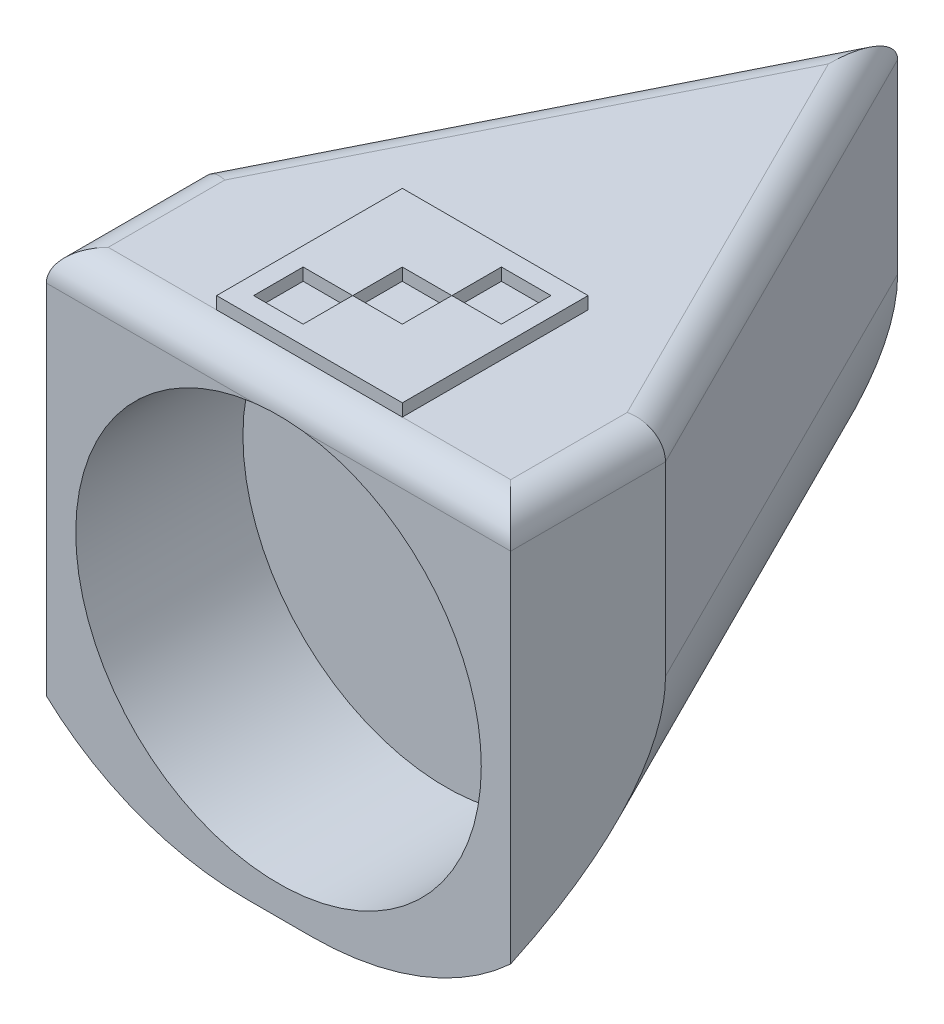
ISO-10303-21;
HEADER;
FILE_DESCRIPTION(('STEP AP214'),'2;1');
FILE_NAME('part.step','',(''),(''),'','','');
FILE_SCHEMA(('AUTOMOTIVE_DESIGN { 1 0 10303 214 1 1 1 1 }'));
ENDSEC;
DATA;
#1=APPLICATION_CONTEXT('core data for automotive mechanical design processes');
#2=APPLICATION_PROTOCOL_DEFINITION('international standard','automotive_design',2000,#1);
#3=PRODUCT_CONTEXT('',#1,'mechanical');
#4=PRODUCT('Part','Part','',(#3));
#5=PRODUCT_RELATED_PRODUCT_CATEGORY('part','',(#4));
#6=PRODUCT_DEFINITION_FORMATION('','',#4);
#7=PRODUCT_DEFINITION_CONTEXT('part definition',#1,'design');
#8=PRODUCT_DEFINITION('design','',#6,#7);
#9=PRODUCT_DEFINITION_SHAPE('','',#8);
#10=(LENGTH_UNIT() NAMED_UNIT(*) SI_UNIT(.MILLI.,.METRE.));
#11=(NAMED_UNIT(*) PLANE_ANGLE_UNIT() SI_UNIT($,.RADIAN.));
#12=(NAMED_UNIT(*) SI_UNIT($,.STERADIAN.) SOLID_ANGLE_UNIT());
#13=UNCERTAINTY_MEASURE_WITH_UNIT(LENGTH_MEASURE(1.E-05),#10,'distance_accuracy_value','');
#14=(GEOMETRIC_REPRESENTATION_CONTEXT(3) GLOBAL_UNCERTAINTY_ASSIGNED_CONTEXT((#13)) GLOBAL_UNIT_ASSIGNED_CONTEXT((#10,
#11,#12)) REPRESENTATION_CONTEXT('',''));
#15=CARTESIAN_POINT('',(0.,0.,0.));
#16=DIRECTION('',(0.,0.,1.));
#17=DIRECTION('',(1.,0.,0.));
#18=AXIS2_PLACEMENT_3D('',#15,#16,#17);
#19=CARTESIAN_POINT('',(0.,77.,0.));
#20=DIRECTION('',(0.,-1.,0.));
#21=DIRECTION('',(0.,0.,-1.));
#22=AXIS2_PLACEMENT_3D('',#19,#20,#21);
#23=PLANE('',#22);
#24=DIRECTION('',(1.,0.,0.));
#25=VECTOR('',#24,1.);
#26=CARTESIAN_POINT('',(-4.00520382004282,77.,76.0052038200428));
#27=LINE('',#26,#25);
#28=CARTESIAN_POINT('',(-4.00520382004282,77.,76.0052038200428));
#29=VERTEX_POINT('',#28);
#30=CARTESIAN_POINT('',(3.99479617995719,77.,76.0052038200428));
#31=VERTEX_POINT('',#30);
#32=EDGE_CURVE('E65',#29,#31,#27,.T.);
#33=ORIENTED_EDGE('',*,*,#32,.T.);
#34=DIRECTION('',(0.,0.,-1.));
#35=VECTOR('',#34,1.);
#36=CARTESIAN_POINT('',(3.99479617995719,77.,84.0052038200428));
#37=LINE('',#36,#35);
#38=CARTESIAN_POINT('',(3.99479617995719,77.,84.0052038200428));
#39=VERTEX_POINT('',#38);
#40=EDGE_CURVE('E289',#39,#31,#37,.T.);
#41=ORIENTED_EDGE('',*,*,#40,.F.);
#42=DIRECTION('',(1.,0.,0.));
#43=VECTOR('',#42,1.);
#44=CARTESIAN_POINT('',(-4.00520382004282,77.,84.0052038200428));
#45=LINE('',#44,#43);
#46=CARTESIAN_POINT('',(-4.00520382004282,77.,84.0052038200428));
#47=VERTEX_POINT('',#46);
#48=EDGE_CURVE('E284',#47,#39,#45,.T.);
#49=ORIENTED_EDGE('',*,*,#48,.F.);
#50=DIRECTION('',(0.,0.,-1.));
#51=VECTOR('',#50,1.);
#52=CARTESIAN_POINT('',(-4.00520382004282,77.,84.0052038200428));
#53=LINE('',#52,#51);
#54=EDGE_CURVE('E280',#47,#29,#53,.T.);
#55=ORIENTED_EDGE('',*,*,#54,.T.);
#56=EDGE_LOOP('',(#33,#41,#49,#55));
#57=FACE_BOUND('',#56,.T.);
#58=DIRECTION('',(-1.,0.,0.));
#59=VECTOR('',#58,1.);
#60=CARTESIAN_POINT('',(15.,77.,65.));
#61=LINE('',#60,#59);
#62=CARTESIAN_POINT('',(15.,77.,65.));
#63=VERTEX_POINT('',#62);
#64=CARTESIAN_POINT('',(-15.,77.,65.));
#65=VERTEX_POINT('',#64);
#66=EDGE_CURVE('E349',#63,#65,#61,.T.);
#67=ORIENTED_EDGE('',*,*,#66,.T.);
#68=DIRECTION('',(0.,0.,-1.));
#69=VECTOR('',#68,1.);
#70=CARTESIAN_POINT('',(-15.,77.,95.));
#71=LINE('',#70,#69);
#72=CARTESIAN_POINT('',(-15.,77.,95.));
#73=VERTEX_POINT('',#72);
#74=EDGE_CURVE('E352',#73,#65,#71,.T.);
#75=ORIENTED_EDGE('',*,*,#74,.F.);
#76=DIRECTION('',(-1.,0.,0.));
#77=VECTOR('',#76,1.);
#78=CARTESIAN_POINT('',(15.,77.,95.));
#79=LINE('',#78,#77);
#80=CARTESIAN_POINT('',(15.,77.,95.));
#81=VERTEX_POINT('',#80);
#82=EDGE_CURVE('E357',#81,#73,#79,.T.);
#83=ORIENTED_EDGE('',*,*,#82,.F.);
#84=DIRECTION('',(0.,0.,-1.));
#85=VECTOR('',#84,1.);
#86=CARTESIAN_POINT('',(15.,77.,95.));
#87=LINE('',#86,#85);
#88=EDGE_CURVE('E361',#81,#63,#87,.T.);
#89=ORIENTED_EDGE('',*,*,#88,.T.);
#90=EDGE_LOOP('',(#67,#75,#83,#89));
#91=FACE_BOUND('',#90,.T.);
#92=DIRECTION('',(1.,0.,0.));
#93=VECTOR('',#92,1.);
#94=CARTESIAN_POINT('',(4.00186724776906,77.,67.998132752231));
#95=LINE('',#94,#93);
#96=CARTESIAN_POINT('',(4.00186724776906,77.,67.998132752231));
#97=VERTEX_POINT('',#96);
#98=CARTESIAN_POINT('',(12.0018672477691,77.,67.998132752231));
#99=VERTEX_POINT('',#98);
#100=EDGE_CURVE('E270',#97,#99,#95,.T.);
#101=ORIENTED_EDGE('',*,*,#100,.T.);
#102=DIRECTION('',(0.,0.,-1.));
#103=VECTOR('',#102,1.);
#104=CARTESIAN_POINT('',(12.0018672477691,77.,75.998132752231));
#105=LINE('',#104,#103);
#106=CARTESIAN_POINT('',(12.0018672477691,77.,75.998132752231));
#107=VERTEX_POINT('',#106);
#108=EDGE_CURVE('E330',#107,#99,#105,.T.);
#109=ORIENTED_EDGE('',*,*,#108,.F.);
#110=DIRECTION('',(1.,0.,0.));
#111=VECTOR('',#110,1.);
#112=CARTESIAN_POINT('',(4.00186724776906,77.,75.998132752231));
#113=LINE('',#112,#111);
#114=CARTESIAN_POINT('',(4.00186724776906,77.,75.998132752231));
#115=VERTEX_POINT('',#114);
#116=EDGE_CURVE('E325',#115,#107,#113,.T.);
#117=ORIENTED_EDGE('',*,*,#116,.F.);
#118=DIRECTION('',(0.,0.,-1.));
#119=VECTOR('',#118,1.);
#120=CARTESIAN_POINT('',(4.00186724776906,77.,75.998132752231));
#121=LINE('',#120,#119);
#122=EDGE_CURVE('E321',#115,#97,#121,.T.);
#123=ORIENTED_EDGE('',*,*,#122,.T.);
#124=EDGE_LOOP('',(#101,#109,#117,#123));
#125=FACE_BOUND('',#124,.T.);
#126=DIRECTION('',(1.,0.,0.));
#127=VECTOR('',#126,1.);
#128=CARTESIAN_POINT('',(-12.0122748878547,77.,84.0122748878547));
#129=LINE('',#128,#127);
#130=CARTESIAN_POINT('',(-12.0122748878547,77.,84.0122748878547));
#131=VERTEX_POINT('',#130);
#132=CARTESIAN_POINT('',(-4.01227488785468,77.,84.0122748878547));
#133=VERTEX_POINT('',#132);
#134=EDGE_CURVE('E57',#131,#133,#129,.T.);
#135=ORIENTED_EDGE('',*,*,#134,.T.);
#136=DIRECTION('',(0.,0.,-1.));
#137=VECTOR('',#136,1.);
#138=CARTESIAN_POINT('',(-4.01227488785467,77.,92.0122748878547));
#139=LINE('',#138,#137);
#140=CARTESIAN_POINT('',(-4.01227488785467,77.,92.0122748878547));
#141=VERTEX_POINT('',#140);
#142=EDGE_CURVE('E232',#141,#133,#139,.T.);
#143=ORIENTED_EDGE('',*,*,#142,.F.);
#144=DIRECTION('',(1.,0.,0.));
#145=VECTOR('',#144,1.);
#146=CARTESIAN_POINT('',(-12.0122748878547,77.,92.0122748878547));
#147=LINE('',#146,#145);
#148=CARTESIAN_POINT('',(-12.0122748878547,77.,92.0122748878547));
#149=VERTEX_POINT('',#148);
#150=EDGE_CURVE('E252',#149,#141,#147,.T.);
#151=ORIENTED_EDGE('',*,*,#150,.F.);
#152=DIRECTION('',(0.,0.,-1.));
#153=VECTOR('',#152,1.);
#154=CARTESIAN_POINT('',(-12.0122748878547,77.,92.0122748878547));
#155=LINE('',#154,#153);
#156=EDGE_CURVE('E225',#149,#131,#155,.T.);
#157=ORIENTED_EDGE('',*,*,#156,.T.);
#158=EDGE_LOOP('',(#135,#143,#151,#157));
#159=FACE_BOUND('',#158,.T.);
#160=ADVANCED_FACE('F39',(#57,#91,#125,#159),#23,.F.);
#161=CARTESIAN_POINT('',(0.,75.,100.));
#162=DIRECTION('',(0.,0.,-1.));
#163=DIRECTION('',(-1.,0.,0.));
#164=AXIS2_PLACEMENT_3D('',#161,#162,#163);
#165=PLANE('',#164);
#166=DIRECTION('',(0.,-1.,0.));
#167=VECTOR('',#166,1.);
#168=CARTESIAN_POINT('',(37.5,75.,100.));
#169=LINE('',#168,#167);
#170=CARTESIAN_POINT('',(37.5,70.,100.));
#171=VERTEX_POINT('',#170);
#172=CARTESIAN_POINT('',(37.5,12.2614493709582,100.));
#173=VERTEX_POINT('',#172);
#174=EDGE_CURVE('E418',#171,#173,#169,.T.);
#175=ORIENTED_EDGE('',*,*,#174,.F.);
#176=DIRECTION('',(1.,0.,0.));
#177=VECTOR('',#176,1.);
#178=CARTESIAN_POINT('',(-37.5,70.,100.));
#179=LINE('',#178,#177);
#180=CARTESIAN_POINT('',(4.03887360535096,70.,100.));
#181=VERTEX_POINT('',#180);
#182=EDGE_CURVE('E49',#171,#181,#179,.F.);
#183=ORIENTED_EDGE('',*,*,#182,.T.);
#184=CARTESIAN_POINT('',(0.,37.5,100.));
#185=DIRECTION('',(0.,0.,1.));
#186=DIRECTION('',(1.,0.,0.));
#187=AXIS2_PLACEMENT_3D('',#184,#185,#186);
#188=CIRCLE('',#187,32.75);
#189=CARTESIAN_POINT('',(-4.03887360535092,70.,100.));
#190=VERTEX_POINT('',#189);
#191=EDGE_CURVE('E398',#190,#181,#188,.T.);
#192=ORIENTED_EDGE('',*,*,#191,.F.);
#193=DIRECTION('',(1.,0.,0.));
#194=VECTOR('',#193,1.);
#195=CARTESIAN_POINT('',(-37.5,70.,100.));
#196=LINE('',#195,#194);
#197=CARTESIAN_POINT('',(-37.5,70.,100.));
#198=VERTEX_POINT('',#197);
#199=EDGE_CURVE('E484',#190,#198,#196,.F.);
#200=ORIENTED_EDGE('',*,*,#199,.T.);
#201=DIRECTION('',(0.,-1.,0.));
#202=VECTOR('',#201,1.);
#203=CARTESIAN_POINT('',(-37.5,75.,100.));
#204=LINE('',#203,#202);
#205=CARTESIAN_POINT('',(-37.5,12.2614493709582,100.));
#206=VERTEX_POINT('',#205);
#207=EDGE_CURVE('E406',#198,#206,#204,.T.);
#208=ORIENTED_EDGE('',*,*,#207,.T.);
#209=CARTESIAN_POINT('',(-5.27864045000419,40.,100.));
#210=DIRECTION('',(0.,0.,-1.));
#211=DIRECTION('',(-1.,0.,0.));
#212=AXIS2_PLACEMENT_3D('',#209,#210,#211);
#213=ELLIPSE('',#212,44.7213595499958,40.);
#214=CARTESIAN_POINT('',(-5.27864045000418,0.,100.));
#215=VERTEX_POINT('',#214);
#216=EDGE_CURVE('E440',#206,#215,#213,.F.);
#217=ORIENTED_EDGE('',*,*,#216,.T.);
#218=DIRECTION('',(1.,0.,0.));
#219=VECTOR('',#218,1.);
#220=CARTESIAN_POINT('',(0.,0.,100.));
#221=LINE('',#220,#219);
#222=CARTESIAN_POINT('',(5.27864045000421,0.,100.));
#223=VERTEX_POINT('',#222);
#224=EDGE_CURVE('E397',#215,#223,#221,.T.);
#225=ORIENTED_EDGE('',*,*,#224,.T.);
#226=CARTESIAN_POINT('',(5.27864045000421,40.,100.));
#227=DIRECTION('',(0.,0.,-1.));
#228=DIRECTION('',(-1.,0.,0.));
#229=AXIS2_PLACEMENT_3D('',#226,#227,#228);
#230=ELLIPSE('',#229,44.7213595499958,40.);
#231=EDGE_CURVE('E436',#223,#173,#230,.F.);
#232=ORIENTED_EDGE('',*,*,#231,.T.);
#233=EDGE_LOOP('',(#175,#183,#192,#200,#208,#217,#225,#232));
#234=FACE_BOUND('',#233,.T.);
#235=ADVANCED_FACE('F529',(#234),#165,.F.);
#236=CARTESIAN_POINT('',(37.5,75.,0.));
#237=DIRECTION('',(1.,0.,0.));
#238=DIRECTION('',(0.,0.,-1.));
#239=AXIS2_PLACEMENT_3D('',#236,#237,#238);
#240=PLANE('',#239);
#241=DIRECTION('',(0.,-1.,0.));
#242=VECTOR('',#241,1.);
#243=CARTESIAN_POINT('',(37.5,75.,75.));
#244=LINE('',#243,#242);
#245=CARTESIAN_POINT('',(37.5,70.,75.));
#246=VERTEX_POINT('',#245);
#247=CARTESIAN_POINT('',(37.5,40.,75.));
#248=VERTEX_POINT('',#247);
#249=EDGE_CURVE('E415',#246,#248,#244,.T.);
#250=ORIENTED_EDGE('',*,*,#249,.F.);
#251=DIRECTION('',(0.,0.,1.));
#252=VECTOR('',#251,1.);
#253=CARTESIAN_POINT('',(37.5,70.,0.));
#254=LINE('',#253,#252);
#255=EDGE_CURVE('E481',#246,#171,#254,.T.);
#256=ORIENTED_EDGE('',*,*,#255,.T.);
#257=ORIENTED_EDGE('',*,*,#174,.T.);
#258=CARTESIAN_POINT('',(37.5,40.,164.442719099992));
#259=DIRECTION('',(1.,0.,0.));
#260=DIRECTION('',(0.,0.,-1.));
#261=AXIS2_PLACEMENT_3D('',#258,#259,#260);
#262=ELLIPSE('',#261,89.4427190999915,40.);
#263=EDGE_CURVE('E443',#173,#248,#262,.T.);
#264=ORIENTED_EDGE('',*,*,#263,.T.);
#265=EDGE_LOOP('',(#250,#256,#257,#264));
#266=FACE_BOUND('',#265,.T.);
#267=ADVANCED_FACE('F525',(#266),#240,.T.);
#268=CARTESIAN_POINT('',(0.,75.,0.));
#269=DIRECTION('',(0.894427190999916,0.,-0.447213595499958));
#270=DIRECTION('',(-0.447213595499958,0.,-0.894427190999916));
#271=AXIS2_PLACEMENT_3D('',#268,#269,#270);
#272=PLANE('',#271);
#273=DIRECTION('',(0.,-1.,0.));
#274=VECTOR('',#273,1.);
#275=CARTESIAN_POINT('',(0.,75.,0.));
#276=LINE('',#275,#274);
#277=CARTESIAN_POINT('',(0.,70.,0.));
#278=VERTEX_POINT('',#277);
#279=CARTESIAN_POINT('',(0.,40.,0.));
#280=VERTEX_POINT('',#279);
#281=EDGE_CURVE('E412',#278,#280,#276,.T.);
#282=ORIENTED_EDGE('',*,*,#281,.F.);
#283=DIRECTION('',(0.447213595499958,0.,0.894427190999916));
#284=VECTOR('',#283,1.);
#285=CARTESIAN_POINT('',(0.,70.,0.));
#286=LINE('',#285,#284);
#287=EDGE_CURVE('E451',#278,#246,#286,.T.);
#288=ORIENTED_EDGE('',*,*,#287,.T.);
#289=ORIENTED_EDGE('',*,*,#249,.T.);
#290=DIRECTION('',(0.447213595499958,0.,0.894427190999916));
#291=VECTOR('',#290,1.);
#292=CARTESIAN_POINT('',(0.,40.,0.));
#293=LINE('',#292,#291);
#294=EDGE_CURVE('E447',#248,#280,#293,.F.);
#295=ORIENTED_EDGE('',*,*,#294,.T.);
#296=EDGE_LOOP('',(#282,#288,#289,#295));
#297=FACE_BOUND('',#296,.T.);
#298=ADVANCED_FACE('F521',(#297),#272,.T.);
#299=CARTESIAN_POINT('',(0.,75.,0.));
#300=DIRECTION('',(-0.894427190999916,0.,-0.447213595499958));
#301=DIRECTION('',(-0.447213595499958,0.,0.894427190999916));
#302=AXIS2_PLACEMENT_3D('',#299,#300,#301);
#303=PLANE('',#302);
#304=DIRECTION('',(0.,-1.,0.));
#305=VECTOR('',#304,1.);
#306=CARTESIAN_POINT('',(-37.5,75.,75.));
#307=LINE('',#306,#305);
#308=CARTESIAN_POINT('',(-37.5,70.,75.));
#309=VERTEX_POINT('',#308);
#310=CARTESIAN_POINT('',(-37.5,40.,75.));
#311=VERTEX_POINT('',#310);
#312=EDGE_CURVE('E409',#309,#311,#307,.T.);
#313=ORIENTED_EDGE('',*,*,#312,.F.);
#314=DIRECTION('',(0.447213595499958,0.,-0.894427190999916));
#315=VECTOR('',#314,1.);
#316=CARTESIAN_POINT('',(0.,70.,0.));
#317=LINE('',#316,#315);
#318=EDGE_CURVE('E475',#309,#278,#317,.T.);
#319=ORIENTED_EDGE('',*,*,#318,.T.);
#320=ORIENTED_EDGE('',*,*,#281,.T.);
#321=DIRECTION('',(0.447213595499958,0.,-0.894427190999916));
#322=VECTOR('',#321,1.);
#323=CARTESIAN_POINT('',(-37.5,40.,75.));
#324=LINE('',#323,#322);
#325=EDGE_CURVE('E428',#280,#311,#324,.F.);
#326=ORIENTED_EDGE('',*,*,#325,.T.);
#327=EDGE_LOOP('',(#313,#319,#320,#326));
#328=FACE_BOUND('',#327,.T.);
#329=ADVANCED_FACE('F517',(#328),#303,.T.);
#330=CARTESIAN_POINT('',(-37.5,75.,0.));
#331=DIRECTION('',(1.,0.,0.));
#332=DIRECTION('',(0.,0.,-1.));
#333=AXIS2_PLACEMENT_3D('',#330,#331,#332);
#334=PLANE('',#333);
#335=ORIENTED_EDGE('',*,*,#207,.F.);
#336=DIRECTION('',(0.,0.,1.));
#337=VECTOR('',#336,1.);
#338=CARTESIAN_POINT('',(-37.5,70.,75.));
#339=LINE('',#338,#337);
#340=EDGE_CURVE('E478',#198,#309,#339,.F.);
#341=ORIENTED_EDGE('',*,*,#340,.T.);
#342=ORIENTED_EDGE('',*,*,#312,.T.);
#343=CARTESIAN_POINT('',(-37.5,40.,164.442719099992));
#344=DIRECTION('',(1.,0.,0.));
#345=DIRECTION('',(0.,0.,1.));
#346=AXIS2_PLACEMENT_3D('',#343,#344,#345);
#347=ELLIPSE('',#346,89.4427190999916,40.);
#348=EDGE_CURVE('E432',#311,#206,#347,.F.);
#349=ORIENTED_EDGE('',*,*,#348,.T.);
#350=EDGE_LOOP('',(#335,#341,#342,#349));
#351=FACE_BOUND('',#350,.T.);
#352=ADVANCED_FACE('F510',(#351),#334,.F.);
#353=CARTESIAN_POINT('',(0.,75.,0.));
#354=DIRECTION('',(0.,1.,0.));
#355=DIRECTION('',(0.,0.,1.));
#356=AXIS2_PLACEMENT_3D('',#353,#354,#355);
#357=PLANE('',#356);
#358=DIRECTION('',(0.,0.,-1.));
#359=VECTOR('',#358,1.);
#360=CARTESIAN_POINT('',(-15.,75.,95.));
#361=LINE('',#360,#359);
#362=CARTESIAN_POINT('',(-15.,75.,95.));
#363=VERTEX_POINT('',#362);
#364=CARTESIAN_POINT('',(-15.,75.,65.));
#365=VERTEX_POINT('',#364);
#366=EDGE_CURVE('E368',#363,#365,#361,.T.);
#367=ORIENTED_EDGE('',*,*,#366,.T.);
#368=DIRECTION('',(-1.,0.,0.));
#369=VECTOR('',#368,1.);
#370=CARTESIAN_POINT('',(15.,75.,65.));
#371=LINE('',#370,#369);
#372=CARTESIAN_POINT('',(15.,75.,65.));
#373=VERTEX_POINT('',#372);
#374=EDGE_CURVE('E234',#373,#365,#371,.T.);
#375=ORIENTED_EDGE('',*,*,#374,.F.);
#376=DIRECTION('',(0.,0.,-1.));
#377=VECTOR('',#376,1.);
#378=CARTESIAN_POINT('',(15.,75.,95.));
#379=LINE('',#378,#377);
#380=CARTESIAN_POINT('',(15.,75.,95.));
#381=VERTEX_POINT('',#380);
#382=EDGE_CURVE('E353',#381,#373,#379,.T.);
#383=ORIENTED_EDGE('',*,*,#382,.F.);
#384=DIRECTION('',(1.,0.,0.));
#385=VECTOR('',#384,1.);
#386=CARTESIAN_POINT('',(37.5,75.,95.));
#387=LINE('',#386,#385);
#388=CARTESIAN_POINT('',(32.5,75.,95.));
#389=VERTEX_POINT('',#388);
#390=EDGE_CURVE('E457',#381,#389,#387,.T.);
#391=ORIENTED_EDGE('',*,*,#390,.T.);
#392=DIRECTION('',(0.,0.,1.));
#393=VECTOR('',#392,1.);
#394=CARTESIAN_POINT('',(32.5,75.,0.));
#395=LINE('',#394,#393);
#396=CARTESIAN_POINT('',(32.5,75.,76.1803398874989));
#397=VERTEX_POINT('',#396);
#398=EDGE_CURVE('E462',#389,#397,#395,.F.);
#399=ORIENTED_EDGE('',*,*,#398,.T.);
#400=DIRECTION('',(0.447213595499958,0.,0.894427190999916));
#401=VECTOR('',#400,1.);
#402=CARTESIAN_POINT('',(-4.47213595499958,75.,2.23606797749979));
#403=LINE('',#402,#401);
#404=CARTESIAN_POINT('',(0.,75.,11.1803398874989));
#405=VERTEX_POINT('',#404);
#406=EDGE_CURVE('E471',#397,#405,#403,.F.);
#407=ORIENTED_EDGE('',*,*,#406,.T.);
#408=DIRECTION('',(0.447213595499958,0.,-0.894427190999916));
#409=VECTOR('',#408,1.);
#410=CARTESIAN_POINT('',(4.47213595499958,75.,2.23606797749979));
#411=LINE('',#410,#409);
#412=CARTESIAN_POINT('',(-32.5,75.,76.1803398874989));
#413=VERTEX_POINT('',#412);
#414=EDGE_CURVE('E468',#405,#413,#411,.F.);
#415=ORIENTED_EDGE('',*,*,#414,.T.);
#416=DIRECTION('',(0.,0.,1.));
#417=VECTOR('',#416,1.);
#418=CARTESIAN_POINT('',(-32.5,75.,100.));
#419=LINE('',#418,#417);
#420=CARTESIAN_POINT('',(-32.5,75.,95.));
#421=VERTEX_POINT('',#420);
#422=EDGE_CURVE('E465',#413,#421,#419,.T.);
#423=ORIENTED_EDGE('',*,*,#422,.T.);
#424=EDGE_CURVE('E458',#421,#363,#387,.T.);
#425=ORIENTED_EDGE('',*,*,#424,.T.);
#426=EDGE_LOOP('',(#367,#375,#383,#391,#399,#407,#415,#423,#425));
#427=FACE_BOUND('',#426,.T.);
#428=ADVANCED_FACE('F507',(#427),#357,.T.);
#429=CARTESIAN_POINT('',(0.,0.,0.));
#430=DIRECTION('',(0.,1.,0.));
#431=DIRECTION('',(0.,0.,1.));
#432=AXIS2_PLACEMENT_3D('',#429,#430,#431);
#433=PLANE('',#432);
#434=ORIENTED_EDGE('',*,*,#224,.F.);
#435=DIRECTION('',(0.447213595499958,0.,-0.894427190999916));
#436=VECTOR('',#435,1.);
#437=CARTESIAN_POINT('',(35.7770876399966,0.,17.8885438199983));
#438=LINE('',#437,#436);
#439=CARTESIAN_POINT('',(0.,0.,89.4427190999916));
#440=VERTEX_POINT('',#439);
#441=EDGE_CURVE('E424',#215,#440,#438,.T.);
#442=ORIENTED_EDGE('',*,*,#441,.T.);
#443=DIRECTION('',(0.447213595499958,0.,0.894427190999916));
#444=VECTOR('',#443,1.);
#445=CARTESIAN_POINT('',(1.7229123600034,0.,92.8885438199984));
#446=LINE('',#445,#444);
#447=EDGE_CURVE('E421',#440,#223,#446,.T.);
#448=ORIENTED_EDGE('',*,*,#447,.T.);
#449=EDGE_LOOP('',(#434,#442,#448));
#450=FACE_BOUND('',#449,.T.);
#451=ADVANCED_FACE('F504',(#450),#433,.F.);
#452=CARTESIAN_POINT('',(0.,37.5,73.));
#453=DIRECTION('',(0.,0.,1.));
#454=DIRECTION('',(1.,0.,0.));
#455=AXIS2_PLACEMENT_3D('',#452,#453,#454);
#456=CYLINDRICAL_SURFACE('',#455,32.75);
#457=CARTESIAN_POINT('',(0.,37.5,73.));
#458=DIRECTION('',(0.,0.,1.));
#459=DIRECTION('',(1.,0.,0.));
#460=AXIS2_PLACEMENT_3D('',#457,#458,#459);
#461=CIRCLE('',#460,32.75);
#462=CARTESIAN_POINT('',(32.75,37.5,73.));
#463=VERTEX_POINT('',#462);
#464=EDGE_CURVE('E393',#463,#463,#461,.T.);
#465=ORIENTED_EDGE('',*,*,#464,.F.);
#466=EDGE_LOOP('',(#465));
#467=FACE_BOUND('',#466,.T.);
#468=ORIENTED_EDGE('',*,*,#191,.T.);
#469=CARTESIAN_POINT('',(4.03887360535096,70.,100.));
#470=CARTESIAN_POINT('',(3.70337776205342,70.0416948839244,99.999965357012));
#471=CARTESIAN_POINT('',(3.36723672450023,70.0781912225375,99.9994772212362));
#472=CARTESIAN_POINT('',(2.69398648134202,70.1407598058941,99.9981255138294));
#473=CARTESIAN_POINT('',(2.35687727561253,70.1668320492973,99.9972619421501));
#474=CARTESIAN_POINT('',(1.68329831489044,70.20844602118,99.9956939050414));
#475=CARTESIAN_POINT('',(1.34683101536045,70.224027483129,99.9949888460904));
#476=CARTESIAN_POINT('',(0.673575810118955,70.2448044620002,99.9940149384421));
#477=CARTESIAN_POINT('',(0.336787905059486,70.25,99.9937460888595));
#478=CARTESIAN_POINT('',(-0.336787905059452,70.25,99.9937460888595));
#479=CARTESIAN_POINT('',(-0.673575810118921,70.2448044620002,99.9940149384421));
#480=CARTESIAN_POINT('',(-1.34683101536042,70.224027483129,99.9949888460904));
#481=CARTESIAN_POINT('',(-1.68329831489041,70.20844602118,99.9956939050414));
#482=CARTESIAN_POINT('',(-2.35687727561249,70.1668320492973,99.9972619421501));
#483=CARTESIAN_POINT('',(-2.69398648134199,70.1407598058941,99.9981255138294));
#484=CARTESIAN_POINT('',(-3.36723672450019,70.0781912225375,99.9994772212362));
#485=CARTESIAN_POINT('',(-3.70337776205338,70.0416948839244,99.999965357012));
#486=CARTESIAN_POINT('',(-4.03887360535092,70.,100.));
#487=B_SPLINE_CURVE_WITH_KNOTS('',3,(#469,#470,#471,#472,#473,#474,#475,#476,#477,#478,#479,
#480,#481,#482,#483,#484,#485,#486),.UNSPECIFIED.,.F.,.F.,(4,2,2,2,2,2,2,2,4),(0.,
1.01418861480331,2.02837736000635,3.03870296144469,4.04902651248923,5.05935006353377,
6.06967566497211,7.08386441017515,8.09805302497846),.UNSPECIFIED.);
#488=EDGE_CURVE('E11',#181,#190,#487,.T.);
#489=ORIENTED_EDGE('',*,*,#488,.T.);
#490=EDGE_LOOP('',(#468,#489));
#491=FACE_BOUND('',#490,.T.);
#492=ADVANCED_FACE('F498',(#467,#491),#456,.F.);
#493=CARTESIAN_POINT('',(0.,37.5,73.));
#494=DIRECTION('',(0.,0.,1.));
#495=DIRECTION('',(1.,0.,0.));
#496=AXIS2_PLACEMENT_3D('',#493,#494,#495);
#497=PLANE('',#496);
#498=ORIENTED_EDGE('',*,*,#464,.T.);
#499=EDGE_LOOP('',(#498));
#500=FACE_BOUND('',#499,.T.);
#501=ADVANCED_FACE('F503',(#500),#497,.T.);
#502=CARTESIAN_POINT('',(-35.7770876399966,40.,17.8885438199983));
#503=DIRECTION('',(-0.447213595499958,0.,-0.894427190999916));
#504=DIRECTION('',(-0.894427190999916,0.,0.447213595499958));
#505=AXIS2_PLACEMENT_3D('',#502,#503,#504);
#506=CYLINDRICAL_SURFACE('',#505,40.);
#507=ORIENTED_EDGE('',*,*,#231,.F.);
#508=ORIENTED_EDGE('',*,*,#447,.F.);
#509=CARTESIAN_POINT('',(0.,40.,89.4427190999916));
#510=DIRECTION('',(-1.,0.,0.));
#511=DIRECTION('',(0.,0.,-1.));
#512=AXIS2_PLACEMENT_3D('',#509,#510,#511);
#513=ELLIPSE('',#512,89.4427190999916,40.);
#514=EDGE_CURVE('E402',#280,#440,#513,.T.);
#515=ORIENTED_EDGE('',*,*,#514,.F.);
#516=ORIENTED_EDGE('',*,*,#294,.F.);
#517=ORIENTED_EDGE('',*,*,#263,.F.);
#518=EDGE_LOOP('',(#507,#508,#515,#516,#517));
#519=FACE_BOUND('',#518,.T.);
#520=ADVANCED_FACE('F537',(#519),#506,.T.);
#521=CARTESIAN_POINT('',(35.7770876399966,40.,17.8885438199983));
#522=DIRECTION('',(-0.447213595499958,0.,0.894427190999916));
#523=DIRECTION('',(0.894427190999916,0.,0.447213595499958));
#524=AXIS2_PLACEMENT_3D('',#521,#522,#523);
#525=CYLINDRICAL_SURFACE('',#524,40.);
#526=ORIENTED_EDGE('',*,*,#348,.F.);
#527=ORIENTED_EDGE('',*,*,#325,.F.);
#528=ORIENTED_EDGE('',*,*,#514,.T.);
#529=ORIENTED_EDGE('',*,*,#441,.F.);
#530=ORIENTED_EDGE('',*,*,#216,.F.);
#531=EDGE_LOOP('',(#526,#527,#528,#529,#530));
#532=FACE_BOUND('',#531,.T.);
#533=ADVANCED_FACE('F534',(#532),#525,.T.);
#534=CARTESIAN_POINT('',(-32.5,70.,0.));
#535=DIRECTION('',(0.,0.,-1.));
#536=DIRECTION('',(-1.,0.,0.));
#537=AXIS2_PLACEMENT_3D('',#534,#535,#536);
#538=CYLINDRICAL_SURFACE('',#537,5.);
#539=CARTESIAN_POINT('',(-32.5,70.,76.1803398874989));
#540=DIRECTION('',(0.229752920547361,0.,-0.97324898946773));
#541=DIRECTION('',(-0.97324898946773,0.,-0.229752920547361));
#542=AXIS2_PLACEMENT_3D('',#539,#540,#541);
#543=ELLIPSE('',#542,5.13743148373008,5.);
#544=EDGE_CURVE('E604',#309,#413,#543,.T.);
#545=ORIENTED_EDGE('',*,*,#544,.F.);
#546=ORIENTED_EDGE('',*,*,#340,.F.);
#547=CARTESIAN_POINT('',(-32.5,70.,95.));
#548=DIRECTION('',(-0.707106781186548,0.,-0.707106781186547));
#549=DIRECTION('',(-0.707106781186547,0.,0.707106781186548));
#550=AXIS2_PLACEMENT_3D('',#547,#548,#549);
#551=ELLIPSE('',#550,7.07106781186548,5.);
#552=EDGE_CURVE('E43',#421,#198,#551,.F.);
#553=ORIENTED_EDGE('',*,*,#552,.F.);
#554=ORIENTED_EDGE('',*,*,#422,.F.);
#555=EDGE_LOOP('',(#545,#546,#553,#554));
#556=FACE_BOUND('',#555,.T.);
#557=ADVANCED_FACE('F41',(#556),#538,.T.);
#558=CARTESIAN_POINT('',(0.,70.,95.));
#559=DIRECTION('',(-1.,0.,0.));
#560=DIRECTION('',(0.,0.,1.));
#561=AXIS2_PLACEMENT_3D('',#558,#559,#560);
#562=CYLINDRICAL_SURFACE('',#561,5.);
#563=ORIENTED_EDGE('',*,*,#488,.F.);
#564=ORIENTED_EDGE('',*,*,#182,.F.);
#565=CARTESIAN_POINT('',(32.5,70.,95.));
#566=DIRECTION('',(-0.707106781186547,0.,0.707106781186548));
#567=DIRECTION('',(-0.707106781186548,0.,-0.707106781186547));
#568=AXIS2_PLACEMENT_3D('',#565,#566,#567);
#569=ELLIPSE('',#568,7.07106781186547,5.);
#570=EDGE_CURVE('E606',#389,#171,#569,.F.);
#571=ORIENTED_EDGE('',*,*,#570,.F.);
#572=ORIENTED_EDGE('',*,*,#390,.F.);
#573=DIRECTION('',(-1.,0.,0.));
#574=VECTOR('',#573,1.);
#575=CARTESIAN_POINT('',(15.,75.,95.));
#576=LINE('',#575,#574);
#577=EDGE_CURVE('E371',#381,#363,#576,.T.);
#578=ORIENTED_EDGE('',*,*,#577,.T.);
#579=ORIENTED_EDGE('',*,*,#424,.F.);
#580=ORIENTED_EDGE('',*,*,#552,.T.);
#581=ORIENTED_EDGE('',*,*,#199,.F.);
#582=EDGE_LOOP('',(#563,#564,#571,#572,#578,#579,#580,#581));
#583=FACE_BOUND('',#582,.T.);
#584=ADVANCED_FACE('F495',(#583),#562,.T.);
#585=CARTESIAN_POINT('',(4.47213595499958,70.,2.23606797749979));
#586=DIRECTION('',(0.447213595499958,0.,-0.894427190999916));
#587=DIRECTION('',(-0.894427190999916,0.,-0.447213595499958));
#588=AXIS2_PLACEMENT_3D('',#585,#586,#587);
#589=CYLINDRICAL_SURFACE('',#588,5.);
#590=ORIENTED_EDGE('',*,*,#544,.T.);
#591=ORIENTED_EDGE('',*,*,#414,.F.);
#592=CARTESIAN_POINT('',(0.,70.,11.1803398874989));
#593=DIRECTION('',(1.,0.,0.));
#594=DIRECTION('',(0.,0.,-1.));
#595=AXIS2_PLACEMENT_3D('',#592,#593,#594);
#596=ELLIPSE('',#595,11.180339887499,5.);
#597=EDGE_CURVE('E610',#278,#405,#596,.T.);
#598=ORIENTED_EDGE('',*,*,#597,.F.);
#599=ORIENTED_EDGE('',*,*,#318,.F.);
#600=EDGE_LOOP('',(#590,#591,#598,#599));
#601=FACE_BOUND('',#600,.T.);
#602=ADVANCED_FACE('F549',(#601),#589,.T.);
#603=CARTESIAN_POINT('',(32.5,70.,0.));
#604=DIRECTION('',(0.,0.,1.));
#605=DIRECTION('',(1.,0.,0.));
#606=AXIS2_PLACEMENT_3D('',#603,#604,#605);
#607=CYLINDRICAL_SURFACE('',#606,5.);
#608=ORIENTED_EDGE('',*,*,#570,.T.);
#609=ORIENTED_EDGE('',*,*,#255,.F.);
#610=CARTESIAN_POINT('',(32.5,70.,76.180339887499));
#611=DIRECTION('',(0.229752920547361,0.,0.97324898946773));
#612=DIRECTION('',(-0.97324898946773,0.,0.229752920547361));
#613=AXIS2_PLACEMENT_3D('',#610,#611,#612);
#614=ELLIPSE('',#613,5.13743148373008,5.);
#615=EDGE_CURVE('E392',#397,#246,#614,.F.);
#616=ORIENTED_EDGE('',*,*,#615,.F.);
#617=ORIENTED_EDGE('',*,*,#398,.F.);
#618=EDGE_LOOP('',(#608,#609,#616,#617));
#619=FACE_BOUND('',#618,.T.);
#620=ADVANCED_FACE('F546',(#619),#607,.T.);
#621=CARTESIAN_POINT('',(-4.47213595499958,70.,2.23606797749979));
#622=DIRECTION('',(0.447213595499958,0.,0.894427190999916));
#623=DIRECTION('',(0.894427190999916,0.,-0.447213595499958));
#624=AXIS2_PLACEMENT_3D('',#621,#622,#623);
#625=CYLINDRICAL_SURFACE('',#624,5.);
#626=ORIENTED_EDGE('',*,*,#597,.T.);
#627=ORIENTED_EDGE('',*,*,#406,.F.);
#628=ORIENTED_EDGE('',*,*,#615,.T.);
#629=ORIENTED_EDGE('',*,*,#287,.F.);
#630=EDGE_LOOP('',(#626,#627,#628,#629));
#631=FACE_BOUND('',#630,.T.);
#632=ADVANCED_FACE('F542',(#631),#625,.T.);
#633=CARTESIAN_POINT('',(15.,77.,65.));
#634=DIRECTION('',(0.,0.,1.));
#635=DIRECTION('',(1.,0.,0.));
#636=AXIS2_PLACEMENT_3D('',#633,#634,#635);
#637=PLANE('',#636);
#638=ORIENTED_EDGE('',*,*,#374,.T.);
#639=DIRECTION('',(0.,-1.,0.));
#640=VECTOR('',#639,1.);
#641=CARTESIAN_POINT('',(-15.,77.,65.));
#642=LINE('',#641,#640);
#643=EDGE_CURVE('E388',#65,#365,#642,.T.);
#644=ORIENTED_EDGE('',*,*,#643,.F.);
#645=ORIENTED_EDGE('',*,*,#66,.F.);
#646=DIRECTION('',(0.,-1.,0.));
#647=VECTOR('',#646,1.);
#648=CARTESIAN_POINT('',(15.,77.,65.));
#649=LINE('',#648,#647);
#650=EDGE_CURVE('E364',#63,#373,#649,.T.);
#651=ORIENTED_EDGE('',*,*,#650,.T.);
#652=EDGE_LOOP('',(#638,#644,#645,#651));
#653=FACE_BOUND('',#652,.T.);
#654=ADVANCED_FACE('F545',(#653),#637,.F.);
#655=CARTESIAN_POINT('',(-15.,77.,95.));
#656=DIRECTION('',(-1.,0.,0.));
#657=DIRECTION('',(0.,0.,1.));
#658=AXIS2_PLACEMENT_3D('',#655,#656,#657);
#659=PLANE('',#658);
#660=ORIENTED_EDGE('',*,*,#366,.F.);
#661=DIRECTION('',(0.,-1.,0.));
#662=VECTOR('',#661,1.);
#663=CARTESIAN_POINT('',(-15.,77.,95.));
#664=LINE('',#663,#662);
#665=EDGE_CURVE('E384',#73,#363,#664,.T.);
#666=ORIENTED_EDGE('',*,*,#665,.F.);
#667=ORIENTED_EDGE('',*,*,#74,.T.);
#668=ORIENTED_EDGE('',*,*,#643,.T.);
#669=EDGE_LOOP('',(#660,#666,#667,#668));
#670=FACE_BOUND('',#669,.T.);
#671=ADVANCED_FACE('F576',(#670),#659,.T.);
#672=CARTESIAN_POINT('',(15.,77.,95.));
#673=DIRECTION('',(0.,0.,1.));
#674=DIRECTION('',(1.,0.,0.));
#675=AXIS2_PLACEMENT_3D('',#672,#673,#674);
#676=PLANE('',#675);
#677=ORIENTED_EDGE('',*,*,#577,.F.);
#678=DIRECTION('',(0.,-1.,0.));
#679=VECTOR('',#678,1.);
#680=CARTESIAN_POINT('',(15.,77.,95.));
#681=LINE('',#680,#679);
#682=EDGE_CURVE('E380',#81,#381,#681,.T.);
#683=ORIENTED_EDGE('',*,*,#682,.F.);
#684=ORIENTED_EDGE('',*,*,#82,.T.);
#685=ORIENTED_EDGE('',*,*,#665,.T.);
#686=EDGE_LOOP('',(#677,#683,#684,#685));
#687=FACE_BOUND('',#686,.T.);
#688=ADVANCED_FACE('F572',(#687),#676,.T.);
#689=CARTESIAN_POINT('',(15.,77.,95.));
#690=DIRECTION('',(-1.,0.,0.));
#691=DIRECTION('',(0.,0.,1.));
#692=AXIS2_PLACEMENT_3D('',#689,#690,#691);
#693=PLANE('',#692);
#694=ORIENTED_EDGE('',*,*,#382,.T.);
#695=ORIENTED_EDGE('',*,*,#650,.F.);
#696=ORIENTED_EDGE('',*,*,#88,.F.);
#697=ORIENTED_EDGE('',*,*,#682,.T.);
#698=EDGE_LOOP('',(#694,#695,#696,#697));
#699=FACE_BOUND('',#698,.T.);
#700=ADVANCED_FACE('F568',(#699),#693,.F.);
#701=CARTESIAN_POINT('',(4.00186724776906,75.,67.998132752231));
#702=DIRECTION('',(0.,0.,1.));
#703=DIRECTION('',(1.,0.,0.));
#704=AXIS2_PLACEMENT_3D('',#701,#702,#703);
#705=PLANE('',#704);
#706=ORIENTED_EDGE('',*,*,#100,.F.);
#707=DIRECTION('',(0.,1.,0.));
#708=VECTOR('',#707,1.);
#709=CARTESIAN_POINT('',(4.00186724776906,75.,67.998132752231));
#710=LINE('',#709,#708);
#711=CARTESIAN_POINT('',(4.00186724776906,75.,67.998132752231));
#712=VERTEX_POINT('',#711);
#713=EDGE_CURVE('E316',#712,#97,#710,.T.);
#714=ORIENTED_EDGE('',*,*,#713,.F.);
#715=DIRECTION('',(1.,0.,0.));
#716=VECTOR('',#715,1.);
#717=CARTESIAN_POINT('',(4.00186724776906,75.,67.998132752231));
#718=LINE('',#717,#716);
#719=CARTESIAN_POINT('',(12.0018672477691,75.,67.998132752231));
#720=VERTEX_POINT('',#719);
#721=EDGE_CURVE('E326',#712,#720,#718,.T.);
#722=ORIENTED_EDGE('',*,*,#721,.T.);
#723=DIRECTION('',(0.,1.,0.));
#724=VECTOR('',#723,1.);
#725=CARTESIAN_POINT('',(12.0018672477691,75.,67.998132752231));
#726=LINE('',#725,#724);
#727=EDGE_CURVE('E307',#720,#99,#726,.T.);
#728=ORIENTED_EDGE('',*,*,#727,.T.);
#729=EDGE_LOOP('',(#706,#714,#722,#728));
#730=FACE_BOUND('',#729,.T.);
#731=ADVANCED_FACE('F571',(#730),#705,.T.);
#732=CARTESIAN_POINT('',(12.0018672477691,75.,75.998132752231));
#733=DIRECTION('',(1.,0.,0.));
#734=DIRECTION('',(0.,0.,-1.));
#735=AXIS2_PLACEMENT_3D('',#732,#733,#734);
#736=PLANE('',#735);
#737=ORIENTED_EDGE('',*,*,#108,.T.);
#738=ORIENTED_EDGE('',*,*,#727,.F.);
#739=DIRECTION('',(0.,0.,-1.));
#740=VECTOR('',#739,1.);
#741=CARTESIAN_POINT('',(12.0018672477691,75.,75.998132752231));
#742=LINE('',#741,#740);
#743=CARTESIAN_POINT('',(12.0018672477691,75.,75.998132752231));
#744=VERTEX_POINT('',#743);
#745=EDGE_CURVE('E343',#744,#720,#742,.T.);
#746=ORIENTED_EDGE('',*,*,#745,.F.);
#747=DIRECTION('',(0.,1.,0.));
#748=VECTOR('',#747,1.);
#749=CARTESIAN_POINT('',(12.0018672477691,75.,75.998132752231));
#750=LINE('',#749,#748);
#751=EDGE_CURVE('E310',#744,#107,#750,.T.);
#752=ORIENTED_EDGE('',*,*,#751,.T.);
#753=EDGE_LOOP('',(#737,#738,#746,#752));
#754=FACE_BOUND('',#753,.T.);
#755=ADVANCED_FACE('F690',(#754),#736,.F.);
#756=CARTESIAN_POINT('',(4.00186724776906,75.,75.998132752231));
#757=DIRECTION('',(0.,0.,1.));
#758=DIRECTION('',(1.,0.,0.));
#759=AXIS2_PLACEMENT_3D('',#756,#757,#758);
#760=PLANE('',#759);
#761=ORIENTED_EDGE('',*,*,#116,.T.);
#762=ORIENTED_EDGE('',*,*,#751,.F.);
#763=DIRECTION('',(1.,0.,0.));
#764=VECTOR('',#763,1.);
#765=CARTESIAN_POINT('',(4.00186724776906,75.,75.998132752231));
#766=LINE('',#765,#764);
#767=CARTESIAN_POINT('',(4.00186724776906,75.,75.998132752231));
#768=VERTEX_POINT('',#767);
#769=EDGE_CURVE('E339',#768,#744,#766,.T.);
#770=ORIENTED_EDGE('',*,*,#769,.F.);
#771=DIRECTION('',(0.,1.,0.));
#772=VECTOR('',#771,1.);
#773=CARTESIAN_POINT('',(4.00186724776906,75.,75.998132752231));
#774=LINE('',#773,#772);
#775=EDGE_CURVE('E313',#768,#115,#774,.T.);
#776=ORIENTED_EDGE('',*,*,#775,.T.);
#777=EDGE_LOOP('',(#761,#762,#770,#776));
#778=FACE_BOUND('',#777,.T.);
#779=ADVANCED_FACE('F700',(#778),#760,.F.);
#780=CARTESIAN_POINT('',(4.00186724776906,75.,75.998132752231));
#781=DIRECTION('',(1.,0.,0.));
#782=DIRECTION('',(0.,0.,-1.));
#783=AXIS2_PLACEMENT_3D('',#780,#781,#782);
#784=PLANE('',#783);
#785=ORIENTED_EDGE('',*,*,#122,.F.);
#786=ORIENTED_EDGE('',*,*,#775,.F.);
#787=DIRECTION('',(0.,0.,-1.));
#788=VECTOR('',#787,1.);
#789=CARTESIAN_POINT('',(4.00186724776906,75.,75.998132752231));
#790=LINE('',#789,#788);
#791=EDGE_CURVE('E320',#768,#712,#790,.T.);
#792=ORIENTED_EDGE('',*,*,#791,.T.);
#793=ORIENTED_EDGE('',*,*,#713,.T.);
#794=EDGE_LOOP('',(#785,#786,#792,#793));
#795=FACE_BOUND('',#794,.T.);
#796=ADVANCED_FACE('F710',(#795),#784,.T.);
#797=CARTESIAN_POINT('',(0.,75.,0.));
#798=DIRECTION('',(0.,1.,0.));
#799=DIRECTION('',(0.,0.,1.));
#800=AXIS2_PLACEMENT_3D('',#797,#798,#799);
#801=PLANE('',#800);
#802=ORIENTED_EDGE('',*,*,#721,.F.);
#803=ORIENTED_EDGE('',*,*,#791,.F.);
#804=ORIENTED_EDGE('',*,*,#769,.T.);
#805=ORIENTED_EDGE('',*,*,#745,.T.);
#806=EDGE_LOOP('',(#802,#803,#804,#805));
#807=FACE_BOUND('',#806,.T.);
#808=ADVANCED_FACE('F566',(#807),#801,.T.);
#809=CARTESIAN_POINT('',(-4.00520382004282,75.,76.0052038200428));
#810=DIRECTION('',(0.,0.,1.));
#811=DIRECTION('',(1.,0.,0.));
#812=AXIS2_PLACEMENT_3D('',#809,#810,#811);
#813=PLANE('',#812);
#814=ORIENTED_EDGE('',*,*,#32,.F.);
#815=DIRECTION('',(0.,1.,0.));
#816=VECTOR('',#815,1.);
#817=CARTESIAN_POINT('',(-4.00520382004282,75.,76.0052038200428));
#818=LINE('',#817,#816);
#819=CARTESIAN_POINT('',(-4.00520382004282,75.,76.0052038200428));
#820=VERTEX_POINT('',#819);
#821=EDGE_CURVE('E276',#820,#29,#818,.T.);
#822=ORIENTED_EDGE('',*,*,#821,.F.);
#823=DIRECTION('',(1.,0.,0.));
#824=VECTOR('',#823,1.);
#825=CARTESIAN_POINT('',(-4.00520382004282,75.,76.0052038200428));
#826=LINE('',#825,#824);
#827=CARTESIAN_POINT('',(3.99479617995719,75.,76.0052038200428));
#828=VERTEX_POINT('',#827);
#829=EDGE_CURVE('E285',#820,#828,#826,.T.);
#830=ORIENTED_EDGE('',*,*,#829,.T.);
#831=DIRECTION('',(0.,1.,0.));
#832=VECTOR('',#831,1.);
#833=CARTESIAN_POINT('',(3.99479617995719,75.,76.0052038200428));
#834=LINE('',#833,#832);
#835=EDGE_CURVE('E266',#828,#31,#834,.T.);
#836=ORIENTED_EDGE('',*,*,#835,.T.);
#837=EDGE_LOOP('',(#814,#822,#830,#836));
#838=FACE_BOUND('',#837,.T.);
#839=ADVANCED_FACE('F728',(#838),#813,.T.);
#840=CARTESIAN_POINT('',(3.99479617995719,75.,84.0052038200428));
#841=DIRECTION('',(1.,0.,0.));
#842=DIRECTION('',(0.,0.,-1.));
#843=AXIS2_PLACEMENT_3D('',#840,#841,#842);
#844=PLANE('',#843);
#845=ORIENTED_EDGE('',*,*,#40,.T.);
#846=ORIENTED_EDGE('',*,*,#835,.F.);
#847=DIRECTION('',(0.,0.,-1.));
#848=VECTOR('',#847,1.);
#849=CARTESIAN_POINT('',(3.99479617995719,75.,84.0052038200428));
#850=LINE('',#849,#848);
#851=CARTESIAN_POINT('',(3.99479617995719,75.,84.0052038200428));
#852=VERTEX_POINT('',#851);
#853=EDGE_CURVE('E301',#852,#828,#850,.T.);
#854=ORIENTED_EDGE('',*,*,#853,.F.);
#855=DIRECTION('',(0.,1.,0.));
#856=VECTOR('',#855,1.);
#857=CARTESIAN_POINT('',(3.99479617995719,75.,84.0052038200428));
#858=LINE('',#857,#856);
#859=EDGE_CURVE('E269',#852,#39,#858,.T.);
#860=ORIENTED_EDGE('',*,*,#859,.T.);
#861=EDGE_LOOP('',(#845,#846,#854,#860));
#862=FACE_BOUND('',#861,.T.);
#863=ADVANCED_FACE('F737',(#862),#844,.F.);
#864=CARTESIAN_POINT('',(-4.00520382004282,75.,84.0052038200428));
#865=DIRECTION('',(0.,0.,1.));
#866=DIRECTION('',(1.,0.,0.));
#867=AXIS2_PLACEMENT_3D('',#864,#865,#866);
#868=PLANE('',#867);
#869=ORIENTED_EDGE('',*,*,#48,.T.);
#870=ORIENTED_EDGE('',*,*,#859,.F.);
#871=DIRECTION('',(1.,0.,0.));
#872=VECTOR('',#871,1.);
#873=CARTESIAN_POINT('',(-4.00520382004282,75.,84.0052038200428));
#874=LINE('',#873,#872);
#875=CARTESIAN_POINT('',(-4.00520382004282,75.,84.0052038200428));
#876=VERTEX_POINT('',#875);
#877=EDGE_CURVE('E297',#876,#852,#874,.T.);
#878=ORIENTED_EDGE('',*,*,#877,.F.);
#879=DIRECTION('',(0.,1.,0.));
#880=VECTOR('',#879,1.);
#881=CARTESIAN_POINT('',(-4.00520382004282,75.,84.0052038200428));
#882=LINE('',#881,#880);
#883=EDGE_CURVE('E273',#876,#47,#882,.T.);
#884=ORIENTED_EDGE('',*,*,#883,.T.);
#885=EDGE_LOOP('',(#869,#870,#878,#884));
#886=FACE_BOUND('',#885,.T.);
#887=ADVANCED_FACE('F746',(#886),#868,.F.);
#888=CARTESIAN_POINT('',(-4.00520382004282,75.,84.0052038200428));
#889=DIRECTION('',(1.,0.,0.));
#890=DIRECTION('',(0.,0.,-1.));
#891=AXIS2_PLACEMENT_3D('',#888,#889,#890);
#892=PLANE('',#891);
#893=ORIENTED_EDGE('',*,*,#54,.F.);
#894=ORIENTED_EDGE('',*,*,#883,.F.);
#895=DIRECTION('',(0.,0.,-1.));
#896=VECTOR('',#895,1.);
#897=CARTESIAN_POINT('',(-4.00520382004282,75.,84.0052038200428));
#898=LINE('',#897,#896);
#899=EDGE_CURVE('E279',#876,#820,#898,.T.);
#900=ORIENTED_EDGE('',*,*,#899,.T.);
#901=ORIENTED_EDGE('',*,*,#821,.T.);
#902=EDGE_LOOP('',(#893,#894,#900,#901));
#903=FACE_BOUND('',#902,.T.);
#904=ADVANCED_FACE('F756',(#903),#892,.T.);
#905=CARTESIAN_POINT('',(0.,75.,0.));
#906=DIRECTION('',(0.,1.,0.));
#907=DIRECTION('',(0.,0.,1.));
#908=AXIS2_PLACEMENT_3D('',#905,#906,#907);
#909=PLANE('',#908);
#910=ORIENTED_EDGE('',*,*,#829,.F.);
#911=ORIENTED_EDGE('',*,*,#899,.F.);
#912=ORIENTED_EDGE('',*,*,#877,.T.);
#913=ORIENTED_EDGE('',*,*,#853,.T.);
#914=EDGE_LOOP('',(#910,#911,#912,#913));
#915=FACE_BOUND('',#914,.T.);
#916=ADVANCED_FACE('F766',(#915),#909,.T.);
#917=CARTESIAN_POINT('',(-12.0122748878547,75.,84.0122748878547));
#918=DIRECTION('',(0.,0.,1.));
#919=DIRECTION('',(1.,0.,0.));
#920=AXIS2_PLACEMENT_3D('',#917,#918,#919);
#921=PLANE('',#920);
#922=ORIENTED_EDGE('',*,*,#134,.F.);
#923=DIRECTION('',(0.,1.,0.));
#924=VECTOR('',#923,1.);
#925=CARTESIAN_POINT('',(-12.0122748878547,75.,84.0122748878547));
#926=LINE('',#925,#924);
#927=CARTESIAN_POINT('',(-12.0122748878547,75.,84.0122748878547));
#928=VERTEX_POINT('',#927);
#929=EDGE_CURVE('E219',#928,#131,#926,.T.);
#930=ORIENTED_EDGE('',*,*,#929,.F.);
#931=DIRECTION('',(1.,0.,0.));
#932=VECTOR('',#931,1.);
#933=CARTESIAN_POINT('',(-12.0122748878547,75.,84.0122748878547));
#934=LINE('',#933,#932);
#935=CARTESIAN_POINT('',(-4.01227488785468,75.,84.0122748878547));
#936=VERTEX_POINT('',#935);
#937=EDGE_CURVE('E214',#928,#936,#934,.T.);
#938=ORIENTED_EDGE('',*,*,#937,.T.);
#939=DIRECTION('',(0.,1.,0.));
#940=VECTOR('',#939,1.);
#941=CARTESIAN_POINT('',(-4.01227488785468,75.,84.0122748878547));
#942=LINE('',#941,#940);
#943=EDGE_CURVE('E217',#936,#133,#942,.T.);
#944=ORIENTED_EDGE('',*,*,#943,.T.);
#945=EDGE_LOOP('',(#922,#930,#938,#944));
#946=FACE_BOUND('',#945,.T.);
#947=ADVANCED_FACE('F216',(#946),#921,.T.);
#948=CARTESIAN_POINT('',(-4.01227488785467,75.,92.0122748878547));
#949=DIRECTION('',(1.,0.,0.));
#950=DIRECTION('',(0.,0.,-1.));
#951=AXIS2_PLACEMENT_3D('',#948,#949,#950);
#952=PLANE('',#951);
#953=ORIENTED_EDGE('',*,*,#142,.T.);
#954=ORIENTED_EDGE('',*,*,#943,.F.);
#955=DIRECTION('',(0.,0.,-1.));
#956=VECTOR('',#955,1.);
#957=CARTESIAN_POINT('',(-4.01227488785467,75.,92.0122748878547));
#958=LINE('',#957,#956);
#959=CARTESIAN_POINT('',(-4.01227488785467,75.,92.0122748878547));
#960=VERTEX_POINT('',#959);
#961=EDGE_CURVE('E224',#960,#936,#958,.T.);
#962=ORIENTED_EDGE('',*,*,#961,.F.);
#963=DIRECTION('',(0.,1.,0.));
#964=VECTOR('',#963,1.);
#965=CARTESIAN_POINT('',(-4.01227488785467,75.,92.0122748878547));
#966=LINE('',#965,#964);
#967=EDGE_CURVE('E235',#960,#141,#966,.T.);
#968=ORIENTED_EDGE('',*,*,#967,.T.);
#969=EDGE_LOOP('',(#953,#954,#962,#968));
#970=FACE_BOUND('',#969,.T.);
#971=ADVANCED_FACE('F229',(#970),#952,.F.);
#972=CARTESIAN_POINT('',(-12.0122748878547,75.,92.0122748878547));
#973=DIRECTION('',(0.,0.,1.));
#974=DIRECTION('',(1.,0.,0.));
#975=AXIS2_PLACEMENT_3D('',#972,#973,#974);
#976=PLANE('',#975);
#977=ORIENTED_EDGE('',*,*,#150,.T.);
#978=ORIENTED_EDGE('',*,*,#967,.F.);
#979=DIRECTION('',(1.,0.,0.));
#980=VECTOR('',#979,1.);
#981=CARTESIAN_POINT('',(-12.0122748878547,75.,92.0122748878547));
#982=LINE('',#981,#980);
#983=CARTESIAN_POINT('',(-12.0122748878547,75.,92.0122748878547));
#984=VERTEX_POINT('',#983);
#985=EDGE_CURVE('E239',#984,#960,#982,.T.);
#986=ORIENTED_EDGE('',*,*,#985,.F.);
#987=DIRECTION('',(0.,1.,0.));
#988=VECTOR('',#987,1.);
#989=CARTESIAN_POINT('',(-12.0122748878547,75.,92.0122748878547));
#990=LINE('',#989,#988);
#991=EDGE_CURVE('E261',#984,#149,#990,.T.);
#992=ORIENTED_EDGE('',*,*,#991,.T.);
#993=EDGE_LOOP('',(#977,#978,#986,#992));
#994=FACE_BOUND('',#993,.T.);
#995=ADVANCED_FACE('F793',(#994),#976,.F.);
#996=CARTESIAN_POINT('',(-12.0122748878547,75.,92.0122748878547));
#997=DIRECTION('',(1.,0.,0.));
#998=DIRECTION('',(0.,0.,-1.));
#999=AXIS2_PLACEMENT_3D('',#996,#997,#998);
#1000=PLANE('',#999);
#1001=ORIENTED_EDGE('',*,*,#156,.F.);
#1002=ORIENTED_EDGE('',*,*,#991,.F.);
#1003=DIRECTION('',(0.,0.,-1.));
#1004=VECTOR('',#1003,1.);
#1005=CARTESIAN_POINT('',(-12.0122748878547,75.,92.0122748878547));
#1006=LINE('',#1005,#1004);
#1007=EDGE_CURVE('E243',#984,#928,#1006,.T.);
#1008=ORIENTED_EDGE('',*,*,#1007,.T.);
#1009=ORIENTED_EDGE('',*,*,#929,.T.);
#1010=EDGE_LOOP('',(#1001,#1002,#1008,#1009));
#1011=FACE_BOUND('',#1010,.T.);
#1012=ADVANCED_FACE('F802',(#1011),#1000,.T.);
#1013=CARTESIAN_POINT('',(0.,75.,0.));
#1014=DIRECTION('',(0.,1.,0.));
#1015=DIRECTION('',(0.,0.,1.));
#1016=AXIS2_PLACEMENT_3D('',#1013,#1014,#1015);
#1017=PLANE('',#1016);
#1018=ORIENTED_EDGE('',*,*,#937,.F.);
#1019=ORIENTED_EDGE('',*,*,#1007,.F.);
#1020=ORIENTED_EDGE('',*,*,#985,.T.);
#1021=ORIENTED_EDGE('',*,*,#961,.T.);
#1022=EDGE_LOOP('',(#1018,#1019,#1020,#1021));
#1023=FACE_BOUND('',#1022,.T.);
#1024=ADVANCED_FACE('F237',(#1023),#1017,.T.);
#1025=CLOSED_SHELL('',(#160,#235,#267,#298,#329,#352,#428,#451,#492,#501,#520,#533,#557,#584,
#602,#620,#632,#654,#671,#688,#700,#731,#755,#779,#796,#808,#839,#863,#887,#904,#916,#947,#971,
#995,#1012,#1024));
#1026=MANIFOLD_SOLID_BREP('B2',#1025);
#1027=ADVANCED_BREP_SHAPE_REPRESENTATION('',(#18,#1026),#14);
#1028=SHAPE_DEFINITION_REPRESENTATION(#9,#1027);
ENDSEC;
END-ISO-10303-21;
